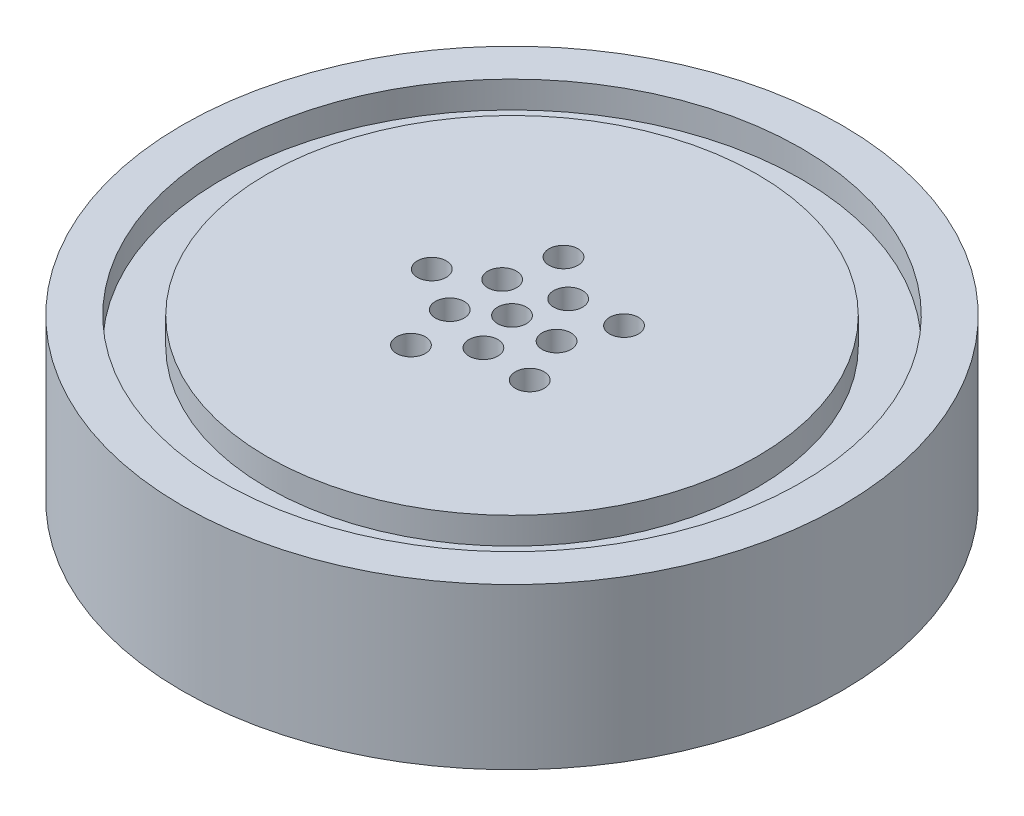
ISO-10303-21;
HEADER;
FILE_DESCRIPTION(('STEP AP214'),'2;1');
FILE_NAME('part.step','',(''),(''),'','','');
FILE_SCHEMA(('AUTOMOTIVE_DESIGN { 1 0 10303 214 1 1 1 1 }'));
ENDSEC;
DATA;
#1=APPLICATION_CONTEXT('core data for automotive mechanical design processes');
#2=APPLICATION_PROTOCOL_DEFINITION('international standard','automotive_design',2000,#1);
#3=PRODUCT_CONTEXT('',#1,'mechanical');
#4=PRODUCT('Part','Part','',(#3));
#5=PRODUCT_RELATED_PRODUCT_CATEGORY('part','',(#4));
#6=PRODUCT_DEFINITION_FORMATION('','',#4);
#7=PRODUCT_DEFINITION_CONTEXT('part definition',#1,'design');
#8=PRODUCT_DEFINITION('design','',#6,#7);
#9=PRODUCT_DEFINITION_SHAPE('','',#8);
#10=(LENGTH_UNIT() NAMED_UNIT(*) SI_UNIT(.MILLI.,.METRE.));
#11=(NAMED_UNIT(*) PLANE_ANGLE_UNIT() SI_UNIT($,.RADIAN.));
#12=(NAMED_UNIT(*) SI_UNIT($,.STERADIAN.) SOLID_ANGLE_UNIT());
#13=UNCERTAINTY_MEASURE_WITH_UNIT(LENGTH_MEASURE(1.E-05),#10,'distance_accuracy_value','');
#14=(GEOMETRIC_REPRESENTATION_CONTEXT(3) GLOBAL_UNCERTAINTY_ASSIGNED_CONTEXT((#13)) GLOBAL_UNIT_ASSIGNED_CONTEXT((#10,
#11,#12)) REPRESENTATION_CONTEXT('',''));
#15=CARTESIAN_POINT('',(0.,0.,0.));
#16=DIRECTION('',(0.,0.,1.));
#17=DIRECTION('',(1.,0.,0.));
#18=AXIS2_PLACEMENT_3D('',#15,#16,#17);
#19=CARTESIAN_POINT('',(0.,11.43,0.));
#20=DIRECTION('',(0.,-1.,0.));
#21=DIRECTION('',(0.,0.,-1.));
#22=AXIS2_PLACEMENT_3D('',#19,#20,#21);
#23=CYLINDRICAL_SURFACE('',#22,23.495);
#24=CARTESIAN_POINT('',(0.,11.43,0.));
#25=DIRECTION('',(0.,1.,0.));
#26=DIRECTION('',(0.,0.,1.));
#27=AXIS2_PLACEMENT_3D('',#24,#25,#26);
#28=CIRCLE('',#27,23.495);
#29=CARTESIAN_POINT('',(0.,11.43,23.495));
#30=VERTEX_POINT('',#29);
#31=EDGE_CURVE('E41',#30,#30,#28,.T.);
#32=ORIENTED_EDGE('',*,*,#31,.F.);
#33=EDGE_LOOP('',(#32));
#34=FACE_BOUND('',#33,.T.);
#35=CARTESIAN_POINT('',(0.,0.,0.));
#36=DIRECTION('',(0.,1.,0.));
#37=DIRECTION('',(0.,0.,1.));
#38=AXIS2_PLACEMENT_3D('',#35,#36,#37);
#39=CIRCLE('',#38,23.495);
#40=CARTESIAN_POINT('',(0.,0.,23.495));
#41=VERTEX_POINT('',#40);
#42=EDGE_CURVE('E45',#41,#41,#39,.T.);
#43=ORIENTED_EDGE('',*,*,#42,.T.);
#44=EDGE_LOOP('',(#43));
#45=FACE_BOUND('',#44,.T.);
#46=ADVANCED_FACE('F35',(#34,#45),#23,.T.);
#47=CARTESIAN_POINT('',(0.,11.43,0.));
#48=DIRECTION('',(0.,1.,0.));
#49=DIRECTION('',(0.,0.,1.));
#50=AXIS2_PLACEMENT_3D('',#47,#48,#49);
#51=PLANE('',#50);
#52=CARTESIAN_POINT('',(0.,11.43,0.));
#53=DIRECTION('',(0.,-1.,0.));
#54=DIRECTION('',(0.,0.,-1.));
#55=AXIS2_PLACEMENT_3D('',#52,#53,#54);
#56=CIRCLE('',#55,20.6248);
#57=CARTESIAN_POINT('',(0.,11.43,-20.6248));
#58=VERTEX_POINT('',#57);
#59=EDGE_CURVE('E57',#58,#58,#56,.T.);
#60=ORIENTED_EDGE('',*,*,#59,.T.);
#61=EDGE_LOOP('',(#60));
#62=FACE_BOUND('',#61,.T.);
#63=ORIENTED_EDGE('',*,*,#31,.T.);
#64=EDGE_LOOP('',(#63));
#65=FACE_BOUND('',#64,.T.);
#66=ADVANCED_FACE('F142',(#62,#65),#51,.T.);
#67=CARTESIAN_POINT('',(0.,0.,0.));
#68=DIRECTION('',(0.,1.,0.));
#69=DIRECTION('',(0.,0.,1.));
#70=AXIS2_PLACEMENT_3D('',#67,#68,#69);
#71=PLANE('',#70);
#72=CARTESIAN_POINT('',(0.,0.,0.));
#73=DIRECTION('',(0.,1.,0.));
#74=DIRECTION('',(0.,0.,1.));
#75=AXIS2_PLACEMENT_3D('',#72,#73,#74);
#76=CIRCLE('',#75,9.525);
#77=CARTESIAN_POINT('',(0.,0.,9.525));
#78=VERTEX_POINT('',#77);
#79=EDGE_CURVE('E10',#78,#78,#76,.F.);
#80=ORIENTED_EDGE('',*,*,#79,.F.);
#81=EDGE_LOOP('',(#80));
#82=FACE_BOUND('',#81,.T.);
#83=ORIENTED_EDGE('',*,*,#42,.F.);
#84=EDGE_LOOP('',(#83));
#85=FACE_BOUND('',#84,.T.);
#86=ADVANCED_FACE('F168',(#82,#85),#71,.F.);
#87=CARTESIAN_POINT('',(0.,-0.47625,0.));
#88=DIRECTION('',(0.,-1.,0.));
#89=DIRECTION('',(0.,0.,-1.));
#90=AXIS2_PLACEMENT_3D('',#87,#88,#89);
#91=CYLINDRICAL_SURFACE('',#90,17.4498);
#92=CARTESIAN_POINT('',(0.,9.525,0.));
#93=DIRECTION('',(0.,-1.,0.));
#94=DIRECTION('',(0.,0.,-1.));
#95=AXIS2_PLACEMENT_3D('',#92,#93,#94);
#96=CIRCLE('',#95,17.4498);
#97=CARTESIAN_POINT('',(0.,9.525,-17.4498));
#98=VERTEX_POINT('',#97);
#99=EDGE_CURVE('E50',#98,#98,#96,.T.);
#100=ORIENTED_EDGE('',*,*,#99,.F.);
#101=EDGE_LOOP('',(#100));
#102=FACE_BOUND('',#101,.T.);
#103=CARTESIAN_POINT('',(0.,11.43,0.));
#104=DIRECTION('',(0.,-1.,0.));
#105=DIRECTION('',(0.,0.,-1.));
#106=AXIS2_PLACEMENT_3D('',#103,#104,#105);
#107=CIRCLE('',#106,17.4498);
#108=CARTESIAN_POINT('',(0.,11.43,-17.4498));
#109=VERTEX_POINT('',#108);
#110=EDGE_CURVE('E60',#109,#109,#107,.T.);
#111=ORIENTED_EDGE('',*,*,#110,.T.);
#112=EDGE_LOOP('',(#111));
#113=FACE_BOUND('',#112,.T.);
#114=ADVANCED_FACE('F165',(#102,#113),#91,.T.);
#115=CARTESIAN_POINT('',(17.4498,9.525,0.));
#116=DIRECTION('',(0.,-1.,0.));
#117=DIRECTION('',(0.,0.,-1.));
#118=AXIS2_PLACEMENT_3D('',#115,#116,#117);
#119=PLANE('',#118);
#120=CARTESIAN_POINT('',(0.,9.525,0.));
#121=DIRECTION('',(0.,-1.,0.));
#122=DIRECTION('',(0.,0.,-1.));
#123=AXIS2_PLACEMENT_3D('',#120,#121,#122);
#124=CIRCLE('',#123,20.6248);
#125=CARTESIAN_POINT('',(0.,9.525,-20.6248));
#126=VERTEX_POINT('',#125);
#127=EDGE_CURVE('E54',#126,#126,#124,.T.);
#128=ORIENTED_EDGE('',*,*,#127,.F.);
#129=EDGE_LOOP('',(#128));
#130=FACE_BOUND('',#129,.T.);
#131=ORIENTED_EDGE('',*,*,#99,.T.);
#132=EDGE_LOOP('',(#131));
#133=FACE_BOUND('',#132,.T.);
#134=ADVANCED_FACE('F167',(#130,#133),#119,.F.);
#135=CARTESIAN_POINT('',(0.,-0.47625,0.));
#136=DIRECTION('',(0.,-1.,0.));
#137=DIRECTION('',(0.,0.,-1.));
#138=AXIS2_PLACEMENT_3D('',#135,#136,#137);
#139=CYLINDRICAL_SURFACE('',#138,20.6248);
#140=ORIENTED_EDGE('',*,*,#59,.F.);
#141=EDGE_LOOP('',(#140));
#142=FACE_BOUND('',#141,.T.);
#143=ORIENTED_EDGE('',*,*,#127,.T.);
#144=EDGE_LOOP('',(#143));
#145=FACE_BOUND('',#144,.T.);
#146=ADVANCED_FACE('F140',(#142,#145),#139,.F.);
#147=CARTESIAN_POINT('',(-5.715,11.43,0.));
#148=DIRECTION('',(0.,1.,0.));
#149=DIRECTION('',(0.,0.,1.));
#150=AXIS2_PLACEMENT_3D('',#147,#148,#149);
#151=CIRCLE('',#150,1.0287);
#152=CARTESIAN_POINT('',(-5.715,11.43,1.0287));
#153=VERTEX_POINT('',#152);
#154=EDGE_CURVE('E129',#153,#153,#151,.T.);
#155=ORIENTED_EDGE('',*,*,#154,.F.);
#156=EDGE_LOOP('',(#155));
#157=FACE_BOUND('',#156,.T.);
#158=CARTESIAN_POINT('',(-2.56862895714041,11.43,-1.86621817602866));
#159=DIRECTION('',(0.,1.,0.));
#160=DIRECTION('',(0.,0.,1.));
#161=AXIS2_PLACEMENT_3D('',#158,#159,#160);
#162=CIRCLE('',#161,1.0287);
#163=CARTESIAN_POINT('',(-2.56862895714041,11.43,-0.837518176028662));
#164=VERTEX_POINT('',#163);
#165=EDGE_CURVE('E123',#164,#164,#162,.T.);
#166=ORIENTED_EDGE('',*,*,#165,.F.);
#167=EDGE_LOOP('',(#166));
#168=FACE_BOUND('',#167,.T.);
#169=CARTESIAN_POINT('',(-1.76603212285273,11.43,-5.43528799062683));
#170=DIRECTION('',(0.,1.,0.));
#171=DIRECTION('',(0.,0.,1.));
#172=AXIS2_PLACEMENT_3D('',#169,#170,#171);
#173=CIRCLE('',#172,1.0287);
#174=CARTESIAN_POINT('',(-1.76603212285273,11.43,-4.40658799062684));
#175=VERTEX_POINT('',#174);
#176=EDGE_CURVE('E117',#175,#175,#173,.T.);
#177=ORIENTED_EDGE('',*,*,#176,.F.);
#178=EDGE_LOOP('',(#177));
#179=FACE_BOUND('',#178,.T.);
#180=CARTESIAN_POINT('',(4.62353212285289,11.43,-3.3591927168514));
#181=DIRECTION('',(0.,1.,0.));
#182=DIRECTION('',(0.,0.,1.));
#183=AXIS2_PLACEMENT_3D('',#180,#181,#182);
#184=CIRCLE('',#183,1.0287);
#185=CARTESIAN_POINT('',(4.62353212285289,11.43,-2.3304927168514));
#186=VERTEX_POINT('',#185);
#187=EDGE_CURVE('E111',#186,#186,#184,.T.);
#188=ORIENTED_EDGE('',*,*,#187,.F.);
#189=EDGE_LOOP('',(#188));
#190=FACE_BOUND('',#189,.T.);
#191=CARTESIAN_POINT('',(4.62353212285275,11.43,3.35919271685159));
#192=DIRECTION('',(0.,1.,0.));
#193=DIRECTION('',(0.,0.,1.));
#194=AXIS2_PLACEMENT_3D('',#191,#192,#193);
#195=CIRCLE('',#194,1.0287);
#196=CARTESIAN_POINT('',(4.62353212285275,11.43,4.38789271685159));
#197=VERTEX_POINT('',#196);
#198=EDGE_CURVE('E105',#197,#197,#195,.T.);
#199=ORIENTED_EDGE('',*,*,#198,.F.);
#200=EDGE_LOOP('',(#199));
#201=FACE_BOUND('',#200,.T.);
#202=CARTESIAN_POINT('',(-1.76603212285289,11.43,5.43528799062679));
#203=DIRECTION('',(0.,1.,0.));
#204=DIRECTION('',(0.,0.,1.));
#205=AXIS2_PLACEMENT_3D('',#202,#203,#204);
#206=CIRCLE('',#205,1.0287);
#207=CARTESIAN_POINT('',(-1.76603212285289,11.43,6.46398799062678));
#208=VERTEX_POINT('',#207);
#209=EDGE_CURVE('E99',#208,#208,#206,.T.);
#210=ORIENTED_EDGE('',*,*,#209,.F.);
#211=EDGE_LOOP('',(#210));
#212=FACE_BOUND('',#211,.T.);
#213=CARTESIAN_POINT('',(0.981128957140372,11.43,-3.0196044392373));
#214=DIRECTION('',(0.,1.,0.));
#215=DIRECTION('',(0.,0.,1.));
#216=AXIS2_PLACEMENT_3D('',#213,#214,#215);
#217=CIRCLE('',#216,1.0287);
#218=CARTESIAN_POINT('',(0.981128957140372,11.43,-1.99090443923731));
#219=VERTEX_POINT('',#218);
#220=EDGE_CURVE('E93',#219,#219,#217,.T.);
#221=ORIENTED_EDGE('',*,*,#220,.F.);
#222=EDGE_LOOP('',(#221));
#223=FACE_BOUND('',#222,.T.);
#224=CARTESIAN_POINT('',(3.1750000000001,11.43,-2.51381680307585E-13));
#225=DIRECTION('',(0.,1.,0.));
#226=DIRECTION('',(0.,0.,1.));
#227=AXIS2_PLACEMENT_3D('',#224,#225,#226);
#228=CIRCLE('',#227,1.0287);
#229=CARTESIAN_POINT('',(3.1750000000001,11.43,1.02869999999975));
#230=VERTEX_POINT('',#229);
#231=EDGE_CURVE('E87',#230,#230,#228,.T.);
#232=ORIENTED_EDGE('',*,*,#231,.F.);
#233=EDGE_LOOP('',(#232));
#234=FACE_BOUND('',#233,.T.);
#235=CARTESIAN_POINT('',(1.04950770296597E-13,11.43,-1.44415729375069E-13));
#236=DIRECTION('',(0.,1.,0.));
#237=DIRECTION('',(0.,0.,1.));
#238=AXIS2_PLACEMENT_3D('',#235,#236,#237);
#239=CIRCLE('',#238,1.0287);
#240=CARTESIAN_POINT('',(1.04950770296597E-13,11.43,1.02869999999985));
#241=VERTEX_POINT('',#240);
#242=EDGE_CURVE('E81',#241,#241,#239,.T.);
#243=ORIENTED_EDGE('',*,*,#242,.F.);
#244=EDGE_LOOP('',(#243));
#245=FACE_BOUND('',#244,.T.);
#246=CARTESIAN_POINT('',(0.981128957140664,11.43,3.01960443923693));
#247=DIRECTION('',(0.,1.,0.));
#248=DIRECTION('',(0.,0.,1.));
#249=AXIS2_PLACEMENT_3D('',#246,#247,#248);
#250=CIRCLE('',#249,1.0287);
#251=CARTESIAN_POINT('',(0.981128957140664,11.43,4.04830443923693));
#252=VERTEX_POINT('',#251);
#253=EDGE_CURVE('E75',#252,#252,#250,.T.);
#254=ORIENTED_EDGE('',*,*,#253,.F.);
#255=EDGE_LOOP('',(#254));
#256=FACE_BOUND('',#255,.T.);
#257=CARTESIAN_POINT('',(-2.56862895714029,11.43,1.86621817602854));
#258=DIRECTION('',(0.,1.,0.));
#259=DIRECTION('',(0.,0.,1.));
#260=AXIS2_PLACEMENT_3D('',#257,#258,#259);
#261=CIRCLE('',#260,1.0287);
#262=CARTESIAN_POINT('',(-2.56862895714029,11.43,2.89491817602854));
#263=VERTEX_POINT('',#262);
#264=EDGE_CURVE('E69',#263,#263,#261,.T.);
#265=ORIENTED_EDGE('',*,*,#264,.F.);
#266=EDGE_LOOP('',(#265));
#267=FACE_BOUND('',#266,.T.);
#268=ORIENTED_EDGE('',*,*,#110,.F.);
#269=EDGE_LOOP('',(#268));
#270=FACE_BOUND('',#269,.T.);
#271=ADVANCED_FACE('F136',(#157,#168,#179,#190,#201,#212,#223,#234,#245,#256,#267,#270),#51,.T.);
#272=CARTESIAN_POINT('',(0.,-6.35,0.));
#273=DIRECTION('',(0.,1.,0.));
#274=DIRECTION('',(0.,0.,1.));
#275=AXIS2_PLACEMENT_3D('',#272,#273,#274);
#276=CYLINDRICAL_SURFACE('',#275,9.525);
#277=CARTESIAN_POINT('',(0.,-6.35,0.));
#278=DIRECTION('',(0.,-1.,0.));
#279=DIRECTION('',(0.,0.,-1.));
#280=AXIS2_PLACEMENT_3D('',#277,#278,#279);
#281=CIRCLE('',#280,9.525);
#282=CARTESIAN_POINT('',(0.,-6.35,-9.525));
#283=VERTEX_POINT('',#282);
#284=EDGE_CURVE('E63',#283,#283,#281,.T.);
#285=ORIENTED_EDGE('',*,*,#284,.F.);
#286=EDGE_LOOP('',(#285));
#287=FACE_BOUND('',#286,.T.);
#288=ORIENTED_EDGE('',*,*,#79,.T.);
#289=EDGE_LOOP('',(#288));
#290=FACE_BOUND('',#289,.T.);
#291=ADVANCED_FACE('F139',(#287,#290),#276,.T.);
#292=CARTESIAN_POINT('',(0.,-6.35,0.));
#293=DIRECTION('',(0.,-1.,0.));
#294=DIRECTION('',(0.,0.,-1.));
#295=AXIS2_PLACEMENT_3D('',#292,#293,#294);
#296=PLANE('',#295);
#297=CARTESIAN_POINT('',(-5.715,-6.35,0.));
#298=DIRECTION('',(0.,-1.,0.));
#299=DIRECTION('',(0.,0.,-1.));
#300=AXIS2_PLACEMENT_3D('',#297,#298,#299);
#301=CIRCLE('',#300,1.0287);
#302=CARTESIAN_POINT('',(-5.715,-6.35,-1.0287));
#303=VERTEX_POINT('',#302);
#304=EDGE_CURVE('E126',#303,#303,#301,.T.);
#305=ORIENTED_EDGE('',*,*,#304,.F.);
#306=EDGE_LOOP('',(#305));
#307=FACE_BOUND('',#306,.T.);
#308=CARTESIAN_POINT('',(-2.56862895714041,-6.35,-1.86621817602866));
#309=DIRECTION('',(0.,-1.,0.));
#310=DIRECTION('',(0.,0.,-1.));
#311=AXIS2_PLACEMENT_3D('',#308,#309,#310);
#312=CIRCLE('',#311,1.0287);
#313=CARTESIAN_POINT('',(-2.56862895714041,-6.35,-2.89491817602866));
#314=VERTEX_POINT('',#313);
#315=EDGE_CURVE('E120',#314,#314,#312,.T.);
#316=ORIENTED_EDGE('',*,*,#315,.F.);
#317=EDGE_LOOP('',(#316));
#318=FACE_BOUND('',#317,.T.);
#319=CARTESIAN_POINT('',(-1.76603212285273,-6.35,-5.43528799062683));
#320=DIRECTION('',(0.,-1.,0.));
#321=DIRECTION('',(0.,0.,-1.));
#322=AXIS2_PLACEMENT_3D('',#319,#320,#321);
#323=CIRCLE('',#322,1.0287);
#324=CARTESIAN_POINT('',(-1.76603212285273,-6.35,-6.46398799062683));
#325=VERTEX_POINT('',#324);
#326=EDGE_CURVE('E114',#325,#325,#323,.T.);
#327=ORIENTED_EDGE('',*,*,#326,.F.);
#328=EDGE_LOOP('',(#327));
#329=FACE_BOUND('',#328,.T.);
#330=CARTESIAN_POINT('',(4.62353212285289,-6.35,-3.3591927168514));
#331=DIRECTION('',(0.,-1.,0.));
#332=DIRECTION('',(0.,0.,-1.));
#333=AXIS2_PLACEMENT_3D('',#330,#331,#332);
#334=CIRCLE('',#333,1.0287);
#335=CARTESIAN_POINT('',(4.62353212285289,-6.35,-4.38789271685139));
#336=VERTEX_POINT('',#335);
#337=EDGE_CURVE('E108',#336,#336,#334,.T.);
#338=ORIENTED_EDGE('',*,*,#337,.F.);
#339=EDGE_LOOP('',(#338));
#340=FACE_BOUND('',#339,.T.);
#341=CARTESIAN_POINT('',(4.62353212285275,-6.35,3.35919271685159));
#342=DIRECTION('',(0.,-1.,0.));
#343=DIRECTION('',(0.,0.,-1.));
#344=AXIS2_PLACEMENT_3D('',#341,#342,#343);
#345=CIRCLE('',#344,1.0287);
#346=CARTESIAN_POINT('',(4.62353212285275,-6.35,2.33049271685159));
#347=VERTEX_POINT('',#346);
#348=EDGE_CURVE('E102',#347,#347,#345,.T.);
#349=ORIENTED_EDGE('',*,*,#348,.F.);
#350=EDGE_LOOP('',(#349));
#351=FACE_BOUND('',#350,.T.);
#352=CARTESIAN_POINT('',(-1.76603212285289,-6.35,5.43528799062679));
#353=DIRECTION('',(0.,-1.,0.));
#354=DIRECTION('',(0.,0.,-1.));
#355=AXIS2_PLACEMENT_3D('',#352,#353,#354);
#356=CIRCLE('',#355,1.0287);
#357=CARTESIAN_POINT('',(-1.76603212285289,-6.35,4.40658799062679));
#358=VERTEX_POINT('',#357);
#359=EDGE_CURVE('E96',#358,#358,#356,.T.);
#360=ORIENTED_EDGE('',*,*,#359,.F.);
#361=EDGE_LOOP('',(#360));
#362=FACE_BOUND('',#361,.T.);
#363=CARTESIAN_POINT('',(0.981128957140372,-6.35,-3.0196044392373));
#364=DIRECTION('',(0.,-1.,0.));
#365=DIRECTION('',(0.,0.,-1.));
#366=AXIS2_PLACEMENT_3D('',#363,#364,#365);
#367=CIRCLE('',#366,1.0287);
#368=CARTESIAN_POINT('',(0.981128957140372,-6.35,-4.0483044392373));
#369=VERTEX_POINT('',#368);
#370=EDGE_CURVE('E90',#369,#369,#367,.T.);
#371=ORIENTED_EDGE('',*,*,#370,.F.);
#372=EDGE_LOOP('',(#371));
#373=FACE_BOUND('',#372,.T.);
#374=CARTESIAN_POINT('',(3.1750000000001,-6.35,-2.51381680307585E-13));
#375=DIRECTION('',(0.,-1.,0.));
#376=DIRECTION('',(0.,0.,-1.));
#377=AXIS2_PLACEMENT_3D('',#374,#375,#376);
#378=CIRCLE('',#377,1.0287);
#379=CARTESIAN_POINT('',(3.1750000000001,-6.35,-1.02870000000025));
#380=VERTEX_POINT('',#379);
#381=EDGE_CURVE('E84',#380,#380,#378,.T.);
#382=ORIENTED_EDGE('',*,*,#381,.F.);
#383=EDGE_LOOP('',(#382));
#384=FACE_BOUND('',#383,.T.);
#385=CARTESIAN_POINT('',(1.04950770296597E-13,-6.35,-1.44415729375069E-13));
#386=DIRECTION('',(0.,-1.,0.));
#387=DIRECTION('',(0.,0.,-1.));
#388=AXIS2_PLACEMENT_3D('',#385,#386,#387);
#389=CIRCLE('',#388,1.0287);
#390=CARTESIAN_POINT('',(1.04950770296597E-13,-6.35,-1.02870000000014));
#391=VERTEX_POINT('',#390);
#392=EDGE_CURVE('E78',#391,#391,#389,.T.);
#393=ORIENTED_EDGE('',*,*,#392,.F.);
#394=EDGE_LOOP('',(#393));
#395=FACE_BOUND('',#394,.T.);
#396=CARTESIAN_POINT('',(0.981128957140664,-6.35,3.01960443923693));
#397=DIRECTION('',(0.,-1.,0.));
#398=DIRECTION('',(0.,0.,-1.));
#399=AXIS2_PLACEMENT_3D('',#396,#397,#398);
#400=CIRCLE('',#399,1.0287);
#401=CARTESIAN_POINT('',(0.981128957140664,-6.35,1.99090443923694));
#402=VERTEX_POINT('',#401);
#403=EDGE_CURVE('E72',#402,#402,#400,.T.);
#404=ORIENTED_EDGE('',*,*,#403,.F.);
#405=EDGE_LOOP('',(#404));
#406=FACE_BOUND('',#405,.T.);
#407=CARTESIAN_POINT('',(-2.56862895714029,-6.35,1.86621817602854));
#408=DIRECTION('',(0.,-1.,0.));
#409=DIRECTION('',(0.,0.,-1.));
#410=AXIS2_PLACEMENT_3D('',#407,#408,#409);
#411=CIRCLE('',#410,1.0287);
#412=CARTESIAN_POINT('',(-2.56862895714029,-6.35,0.837518176028546));
#413=VERTEX_POINT('',#412);
#414=EDGE_CURVE('E66',#413,#413,#411,.T.);
#415=ORIENTED_EDGE('',*,*,#414,.F.);
#416=EDGE_LOOP('',(#415));
#417=FACE_BOUND('',#416,.T.);
#418=ORIENTED_EDGE('',*,*,#284,.T.);
#419=EDGE_LOOP('',(#418));
#420=FACE_BOUND('',#419,.T.);
#421=ADVANCED_FACE('F202',(#307,#318,#329,#340,#351,#362,#373,#384,#395,#406,#417,#420),#296,.T.);
#422=CARTESIAN_POINT('',(-2.56862895714029,11.43,1.86621817602854));
#423=DIRECTION('',(0.,1.,0.));
#424=DIRECTION('',(0.,0.,1.));
#425=AXIS2_PLACEMENT_3D('',#422,#423,#424);
#426=CYLINDRICAL_SURFACE('',#425,1.0287);
#427=ORIENTED_EDGE('',*,*,#264,.T.);
#428=EDGE_LOOP('',(#427));
#429=FACE_BOUND('',#428,.T.);
#430=ORIENTED_EDGE('',*,*,#414,.T.);
#431=EDGE_LOOP('',(#430));
#432=FACE_BOUND('',#431,.T.);
#433=ADVANCED_FACE('F206',(#429,#432),#426,.F.);
#434=CARTESIAN_POINT('',(0.981128957140664,11.43,3.01960443923693));
#435=DIRECTION('',(0.,1.,0.));
#436=DIRECTION('',(0.,0.,1.));
#437=AXIS2_PLACEMENT_3D('',#434,#435,#436);
#438=CYLINDRICAL_SURFACE('',#437,1.0287);
#439=ORIENTED_EDGE('',*,*,#253,.T.);
#440=EDGE_LOOP('',(#439));
#441=FACE_BOUND('',#440,.T.);
#442=ORIENTED_EDGE('',*,*,#403,.T.);
#443=EDGE_LOOP('',(#442));
#444=FACE_BOUND('',#443,.T.);
#445=ADVANCED_FACE('F210',(#441,#444),#438,.F.);
#446=CARTESIAN_POINT('',(1.04950770296597E-13,11.43,-1.44415729375069E-13));
#447=DIRECTION('',(0.,1.,0.));
#448=DIRECTION('',(0.,0.,1.));
#449=AXIS2_PLACEMENT_3D('',#446,#447,#448);
#450=CYLINDRICAL_SURFACE('',#449,1.0287);
#451=ORIENTED_EDGE('',*,*,#242,.T.);
#452=EDGE_LOOP('',(#451));
#453=FACE_BOUND('',#452,.T.);
#454=ORIENTED_EDGE('',*,*,#392,.T.);
#455=EDGE_LOOP('',(#454));
#456=FACE_BOUND('',#455,.T.);
#457=ADVANCED_FACE('F214',(#453,#456),#450,.F.);
#458=CARTESIAN_POINT('',(3.1750000000001,11.43,-2.51381680307585E-13));
#459=DIRECTION('',(0.,1.,0.));
#460=DIRECTION('',(0.,0.,1.));
#461=AXIS2_PLACEMENT_3D('',#458,#459,#460);
#462=CYLINDRICAL_SURFACE('',#461,1.0287);
#463=ORIENTED_EDGE('',*,*,#231,.T.);
#464=EDGE_LOOP('',(#463));
#465=FACE_BOUND('',#464,.T.);
#466=ORIENTED_EDGE('',*,*,#381,.T.);
#467=EDGE_LOOP('',(#466));
#468=FACE_BOUND('',#467,.T.);
#469=ADVANCED_FACE('F218',(#465,#468),#462,.F.);
#470=CARTESIAN_POINT('',(0.981128957140372,11.43,-3.0196044392373));
#471=DIRECTION('',(0.,1.,0.));
#472=DIRECTION('',(0.,0.,1.));
#473=AXIS2_PLACEMENT_3D('',#470,#471,#472);
#474=CYLINDRICAL_SURFACE('',#473,1.0287);
#475=ORIENTED_EDGE('',*,*,#220,.T.);
#476=EDGE_LOOP('',(#475));
#477=FACE_BOUND('',#476,.T.);
#478=ORIENTED_EDGE('',*,*,#370,.T.);
#479=EDGE_LOOP('',(#478));
#480=FACE_BOUND('',#479,.T.);
#481=ADVANCED_FACE('F222',(#477,#480),#474,.F.);
#482=CARTESIAN_POINT('',(-1.76603212285289,11.43,5.43528799062679));
#483=DIRECTION('',(0.,1.,0.));
#484=DIRECTION('',(0.,0.,1.));
#485=AXIS2_PLACEMENT_3D('',#482,#483,#484);
#486=CYLINDRICAL_SURFACE('',#485,1.0287);
#487=ORIENTED_EDGE('',*,*,#209,.T.);
#488=EDGE_LOOP('',(#487));
#489=FACE_BOUND('',#488,.T.);
#490=ORIENTED_EDGE('',*,*,#359,.T.);
#491=EDGE_LOOP('',(#490));
#492=FACE_BOUND('',#491,.T.);
#493=ADVANCED_FACE('F226',(#489,#492),#486,.F.);
#494=CARTESIAN_POINT('',(4.62353212285275,11.43,3.35919271685159));
#495=DIRECTION('',(0.,1.,0.));
#496=DIRECTION('',(0.,0.,1.));
#497=AXIS2_PLACEMENT_3D('',#494,#495,#496);
#498=CYLINDRICAL_SURFACE('',#497,1.0287);
#499=ORIENTED_EDGE('',*,*,#198,.T.);
#500=EDGE_LOOP('',(#499));
#501=FACE_BOUND('',#500,.T.);
#502=ORIENTED_EDGE('',*,*,#348,.T.);
#503=EDGE_LOOP('',(#502));
#504=FACE_BOUND('',#503,.T.);
#505=ADVANCED_FACE('F230',(#501,#504),#498,.F.);
#506=CARTESIAN_POINT('',(4.62353212285289,11.43,-3.3591927168514));
#507=DIRECTION('',(0.,1.,0.));
#508=DIRECTION('',(0.,0.,1.));
#509=AXIS2_PLACEMENT_3D('',#506,#507,#508);
#510=CYLINDRICAL_SURFACE('',#509,1.0287);
#511=ORIENTED_EDGE('',*,*,#187,.T.);
#512=EDGE_LOOP('',(#511));
#513=FACE_BOUND('',#512,.T.);
#514=ORIENTED_EDGE('',*,*,#337,.T.);
#515=EDGE_LOOP('',(#514));
#516=FACE_BOUND('',#515,.T.);
#517=ADVANCED_FACE('F234',(#513,#516),#510,.F.);
#518=CARTESIAN_POINT('',(-1.76603212285273,11.43,-5.43528799062683));
#519=DIRECTION('',(0.,1.,0.));
#520=DIRECTION('',(0.,0.,1.));
#521=AXIS2_PLACEMENT_3D('',#518,#519,#520);
#522=CYLINDRICAL_SURFACE('',#521,1.0287);
#523=ORIENTED_EDGE('',*,*,#176,.T.);
#524=EDGE_LOOP('',(#523));
#525=FACE_BOUND('',#524,.T.);
#526=ORIENTED_EDGE('',*,*,#326,.T.);
#527=EDGE_LOOP('',(#526));
#528=FACE_BOUND('',#527,.T.);
#529=ADVANCED_FACE('F238',(#525,#528),#522,.F.);
#530=CARTESIAN_POINT('',(-2.56862895714041,11.43,-1.86621817602866));
#531=DIRECTION('',(0.,1.,0.));
#532=DIRECTION('',(0.,0.,1.));
#533=AXIS2_PLACEMENT_3D('',#530,#531,#532);
#534=CYLINDRICAL_SURFACE('',#533,1.0287);
#535=ORIENTED_EDGE('',*,*,#165,.T.);
#536=EDGE_LOOP('',(#535));
#537=FACE_BOUND('',#536,.T.);
#538=ORIENTED_EDGE('',*,*,#315,.T.);
#539=EDGE_LOOP('',(#538));
#540=FACE_BOUND('',#539,.T.);
#541=ADVANCED_FACE('F242',(#537,#540),#534,.F.);
#542=CARTESIAN_POINT('',(-5.715,11.43,0.));
#543=DIRECTION('',(0.,1.,0.));
#544=DIRECTION('',(0.,0.,1.));
#545=AXIS2_PLACEMENT_3D('',#542,#543,#544);
#546=CYLINDRICAL_SURFACE('',#545,1.0287);
#547=ORIENTED_EDGE('',*,*,#154,.T.);
#548=EDGE_LOOP('',(#547));
#549=FACE_BOUND('',#548,.T.);
#550=ORIENTED_EDGE('',*,*,#304,.T.);
#551=EDGE_LOOP('',(#550));
#552=FACE_BOUND('',#551,.T.);
#553=ADVANCED_FACE('F133',(#549,#552),#546,.F.);
#554=CLOSED_SHELL('',(#46,#66,#86,#114,#134,#146,#271,#291,#421,#433,#445,#457,#469,#481,#493,
#505,#517,#529,#541,#553));
#555=MANIFOLD_SOLID_BREP('B2',#554);
#556=ADVANCED_BREP_SHAPE_REPRESENTATION('',(#18,#555),#14);
#557=SHAPE_DEFINITION_REPRESENTATION(#9,#556);
ENDSEC;
END-ISO-10303-21;
